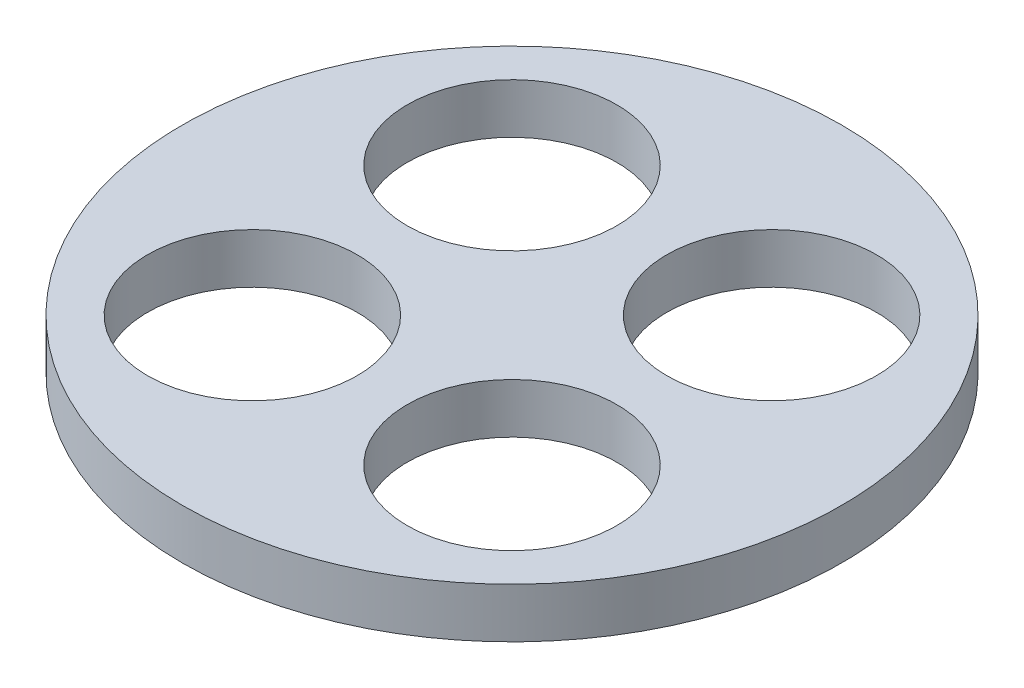
ISO-10303-21;
HEADER;
FILE_DESCRIPTION(('STEP AP214'),'2;1');
FILE_NAME('part.step','',(''),(''),'','','');
FILE_SCHEMA(('AUTOMOTIVE_DESIGN { 1 0 10303 214 1 1 1 1 }'));
ENDSEC;
DATA;
#1=APPLICATION_CONTEXT('core data for automotive mechanical design processes');
#2=APPLICATION_PROTOCOL_DEFINITION('international standard','automotive_design',2000,#1);
#3=PRODUCT_CONTEXT('',#1,'mechanical');
#4=PRODUCT('Part','Part','',(#3));
#5=PRODUCT_RELATED_PRODUCT_CATEGORY('part','',(#4));
#6=PRODUCT_DEFINITION_FORMATION('','',#4);
#7=PRODUCT_DEFINITION_CONTEXT('part definition',#1,'design');
#8=PRODUCT_DEFINITION('design','',#6,#7);
#9=PRODUCT_DEFINITION_SHAPE('','',#8);
#10=(LENGTH_UNIT() NAMED_UNIT(*) SI_UNIT(.MILLI.,.METRE.));
#11=(NAMED_UNIT(*) PLANE_ANGLE_UNIT() SI_UNIT($,.RADIAN.));
#12=(NAMED_UNIT(*) SI_UNIT($,.STERADIAN.) SOLID_ANGLE_UNIT());
#13=UNCERTAINTY_MEASURE_WITH_UNIT(LENGTH_MEASURE(1.E-05),#10,'distance_accuracy_value','');
#14=(GEOMETRIC_REPRESENTATION_CONTEXT(3) GLOBAL_UNCERTAINTY_ASSIGNED_CONTEXT((#13)) GLOBAL_UNIT_ASSIGNED_CONTEXT((#10,
#11,#12)) REPRESENTATION_CONTEXT('',''));
#15=CARTESIAN_POINT('',(0.,0.,0.));
#16=DIRECTION('',(0.,0.,1.));
#17=DIRECTION('',(1.,0.,0.));
#18=AXIS2_PLACEMENT_3D('',#15,#16,#17);
#19=CARTESIAN_POINT('',(0.,2.5,0.));
#20=DIRECTION('',(0.,1.,0.));
#21=DIRECTION('',(0.,0.,1.));
#22=AXIS2_PLACEMENT_3D('',#19,#20,#21);
#23=PLANE('',#22);
#24=CARTESIAN_POINT('',(-6.5,2.5,-6.5));
#25=DIRECTION('',(0.,1.,0.));
#26=DIRECTION('',(0.,0.,1.));
#27=AXIS2_PLACEMENT_3D('',#24,#25,#26);
#28=CIRCLE('',#27,5.25);
#29=CARTESIAN_POINT('',(-6.5,2.5,-1.25));
#30=VERTEX_POINT('',#29);
#31=EDGE_CURVE('E56',#30,#30,#28,.T.);
#32=ORIENTED_EDGE('',*,*,#31,.F.);
#33=EDGE_LOOP('',(#32));
#34=FACE_BOUND('',#33,.T.);
#35=CARTESIAN_POINT('',(6.5,2.5,6.5));
#36=DIRECTION('',(0.,1.,0.));
#37=DIRECTION('',(0.,0.,1.));
#38=AXIS2_PLACEMENT_3D('',#35,#36,#37);
#39=CIRCLE('',#38,5.25);
#40=CARTESIAN_POINT('',(6.5,2.5,11.75));
#41=VERTEX_POINT('',#40);
#42=EDGE_CURVE('E45',#41,#41,#39,.T.);
#43=ORIENTED_EDGE('',*,*,#42,.F.);
#44=EDGE_LOOP('',(#43));
#45=FACE_BOUND('',#44,.T.);
#46=CARTESIAN_POINT('',(0.,2.5,0.));
#47=DIRECTION('',(0.,1.,0.));
#48=DIRECTION('',(0.,0.,1.));
#49=AXIS2_PLACEMENT_3D('',#46,#47,#48);
#50=CIRCLE('',#49,16.5);
#51=CARTESIAN_POINT('',(0.,2.5,16.5));
#52=VERTEX_POINT('',#51);
#53=EDGE_CURVE('E10',#52,#52,#50,.T.);
#54=ORIENTED_EDGE('',*,*,#53,.T.);
#55=EDGE_LOOP('',(#54));
#56=FACE_BOUND('',#55,.T.);
#57=CARTESIAN_POINT('',(-6.5,2.5,6.5));
#58=DIRECTION('',(0.,1.,0.));
#59=DIRECTION('',(0.,0.,1.));
#60=AXIS2_PLACEMENT_3D('',#57,#58,#59);
#61=CIRCLE('',#60,5.25);
#62=CARTESIAN_POINT('',(-6.5,2.5,11.75));
#63=VERTEX_POINT('',#62);
#64=EDGE_CURVE('E50',#63,#63,#61,.T.);
#65=ORIENTED_EDGE('',*,*,#64,.F.);
#66=EDGE_LOOP('',(#65));
#67=FACE_BOUND('',#66,.T.);
#68=CARTESIAN_POINT('',(6.5,2.5,-6.5));
#69=DIRECTION('',(0.,1.,0.));
#70=DIRECTION('',(0.,0.,1.));
#71=AXIS2_PLACEMENT_3D('',#68,#69,#70);
#72=CIRCLE('',#71,5.25);
#73=CARTESIAN_POINT('',(6.5,2.5,-1.25));
#74=VERTEX_POINT('',#73);
#75=EDGE_CURVE('E62',#74,#74,#72,.T.);
#76=ORIENTED_EDGE('',*,*,#75,.F.);
#77=EDGE_LOOP('',(#76));
#78=FACE_BOUND('',#77,.T.);
#79=ADVANCED_FACE('F34',(#34,#45,#56,#67,#78),#23,.T.);
#80=CARTESIAN_POINT('',(0.,0.,0.));
#81=DIRECTION('',(0.,1.,0.));
#82=DIRECTION('',(0.,0.,1.));
#83=AXIS2_PLACEMENT_3D('',#80,#81,#82);
#84=PLANE('',#83);
#85=CARTESIAN_POINT('',(0.,0.,0.));
#86=DIRECTION('',(0.,1.,0.));
#87=DIRECTION('',(0.,0.,1.));
#88=AXIS2_PLACEMENT_3D('',#85,#86,#87);
#89=CIRCLE('',#88,16.5);
#90=CARTESIAN_POINT('',(0.,0.,16.5));
#91=VERTEX_POINT('',#90);
#92=EDGE_CURVE('E38',#91,#91,#89,.T.);
#93=ORIENTED_EDGE('',*,*,#92,.F.);
#94=EDGE_LOOP('',(#93));
#95=FACE_BOUND('',#94,.T.);
#96=CARTESIAN_POINT('',(6.5,0.,6.5));
#97=DIRECTION('',(0.,1.,0.));
#98=DIRECTION('',(0.,0.,1.));
#99=AXIS2_PLACEMENT_3D('',#96,#97,#98);
#100=CIRCLE('',#99,5.25);
#101=CARTESIAN_POINT('',(6.5,0.,11.75));
#102=VERTEX_POINT('',#101);
#103=EDGE_CURVE('E47',#102,#102,#100,.T.);
#104=ORIENTED_EDGE('',*,*,#103,.T.);
#105=EDGE_LOOP('',(#104));
#106=FACE_BOUND('',#105,.T.);
#107=CARTESIAN_POINT('',(-6.5,0.,6.5));
#108=DIRECTION('',(0.,1.,0.));
#109=DIRECTION('',(0.,0.,1.));
#110=AXIS2_PLACEMENT_3D('',#107,#108,#109);
#111=CIRCLE('',#110,5.25);
#112=CARTESIAN_POINT('',(-6.5,0.,11.75));
#113=VERTEX_POINT('',#112);
#114=EDGE_CURVE('E53',#113,#113,#111,.T.);
#115=ORIENTED_EDGE('',*,*,#114,.T.);
#116=EDGE_LOOP('',(#115));
#117=FACE_BOUND('',#116,.T.);
#118=CARTESIAN_POINT('',(-6.5,0.,-6.5));
#119=DIRECTION('',(0.,1.,0.));
#120=DIRECTION('',(0.,0.,1.));
#121=AXIS2_PLACEMENT_3D('',#118,#119,#120);
#122=CIRCLE('',#121,5.25);
#123=CARTESIAN_POINT('',(-6.5,0.,-1.25));
#124=VERTEX_POINT('',#123);
#125=EDGE_CURVE('E59',#124,#124,#122,.T.);
#126=ORIENTED_EDGE('',*,*,#125,.T.);
#127=EDGE_LOOP('',(#126));
#128=FACE_BOUND('',#127,.T.);
#129=CARTESIAN_POINT('',(6.5,0.,-6.5));
#130=DIRECTION('',(0.,1.,0.));
#131=DIRECTION('',(0.,0.,1.));
#132=AXIS2_PLACEMENT_3D('',#129,#130,#131);
#133=CIRCLE('',#132,5.25);
#134=CARTESIAN_POINT('',(6.5,0.,-1.25));
#135=VERTEX_POINT('',#134);
#136=EDGE_CURVE('E65',#135,#135,#133,.T.);
#137=ORIENTED_EDGE('',*,*,#136,.T.);
#138=EDGE_LOOP('',(#137));
#139=FACE_BOUND('',#138,.T.);
#140=ADVANCED_FACE('F75',(#95,#106,#117,#128,#139),#84,.F.);
#141=CARTESIAN_POINT('',(0.,2.5,0.));
#142=DIRECTION('',(0.,-1.,0.));
#143=DIRECTION('',(0.,0.,-1.));
#144=AXIS2_PLACEMENT_3D('',#141,#142,#143);
#145=CYLINDRICAL_SURFACE('',#144,16.5);
#146=ORIENTED_EDGE('',*,*,#53,.F.);
#147=EDGE_LOOP('',(#146));
#148=FACE_BOUND('',#147,.T.);
#149=ORIENTED_EDGE('',*,*,#92,.T.);
#150=EDGE_LOOP('',(#149));
#151=FACE_BOUND('',#150,.T.);
#152=ADVANCED_FACE('F36',(#148,#151),#145,.T.);
#153=CARTESIAN_POINT('',(6.5,2.5,6.5));
#154=DIRECTION('',(0.,-1.,0.));
#155=DIRECTION('',(0.,0.,-1.));
#156=AXIS2_PLACEMENT_3D('',#153,#154,#155);
#157=CYLINDRICAL_SURFACE('',#156,5.25);
#158=ORIENTED_EDGE('',*,*,#42,.T.);
#159=EDGE_LOOP('',(#158));
#160=FACE_BOUND('',#159,.T.);
#161=ORIENTED_EDGE('',*,*,#103,.F.);
#162=EDGE_LOOP('',(#161));
#163=FACE_BOUND('',#162,.T.);
#164=ADVANCED_FACE('F85',(#160,#163),#157,.F.);
#165=CARTESIAN_POINT('',(-6.5,2.5,6.5));
#166=DIRECTION('',(0.,-1.,0.));
#167=DIRECTION('',(0.,0.,-1.));
#168=AXIS2_PLACEMENT_3D('',#165,#166,#167);
#169=CYLINDRICAL_SURFACE('',#168,5.25);
#170=ORIENTED_EDGE('',*,*,#64,.T.);
#171=EDGE_LOOP('',(#170));
#172=FACE_BOUND('',#171,.T.);
#173=ORIENTED_EDGE('',*,*,#114,.F.);
#174=EDGE_LOOP('',(#173));
#175=FACE_BOUND('',#174,.T.);
#176=ADVANCED_FACE('F88',(#172,#175),#169,.F.);
#177=CARTESIAN_POINT('',(-6.5,2.5,-6.5));
#178=DIRECTION('',(0.,-1.,0.));
#179=DIRECTION('',(0.,0.,-1.));
#180=AXIS2_PLACEMENT_3D('',#177,#178,#179);
#181=CYLINDRICAL_SURFACE('',#180,5.25);
#182=ORIENTED_EDGE('',*,*,#31,.T.);
#183=EDGE_LOOP('',(#182));
#184=FACE_BOUND('',#183,.T.);
#185=ORIENTED_EDGE('',*,*,#125,.F.);
#186=EDGE_LOOP('',(#185));
#187=FACE_BOUND('',#186,.T.);
#188=ADVANCED_FACE('F92',(#184,#187),#181,.F.);
#189=CARTESIAN_POINT('',(6.5,2.5,-6.5));
#190=DIRECTION('',(0.,-1.,0.));
#191=DIRECTION('',(0.,0.,-1.));
#192=AXIS2_PLACEMENT_3D('',#189,#190,#191);
#193=CYLINDRICAL_SURFACE('',#192,5.25);
#194=ORIENTED_EDGE('',*,*,#75,.T.);
#195=EDGE_LOOP('',(#194));
#196=FACE_BOUND('',#195,.T.);
#197=ORIENTED_EDGE('',*,*,#136,.F.);
#198=EDGE_LOOP('',(#197));
#199=FACE_BOUND('',#198,.T.);
#200=ADVANCED_FACE('F71',(#196,#199),#193,.F.);
#201=CLOSED_SHELL('',(#79,#140,#152,#164,#176,#188,#200));
#202=MANIFOLD_SOLID_BREP('B2',#201);
#203=ADVANCED_BREP_SHAPE_REPRESENTATION('',(#18,#202),#14);
#204=SHAPE_DEFINITION_REPRESENTATION(#9,#203);
ENDSEC;
END-ISO-10303-21;
